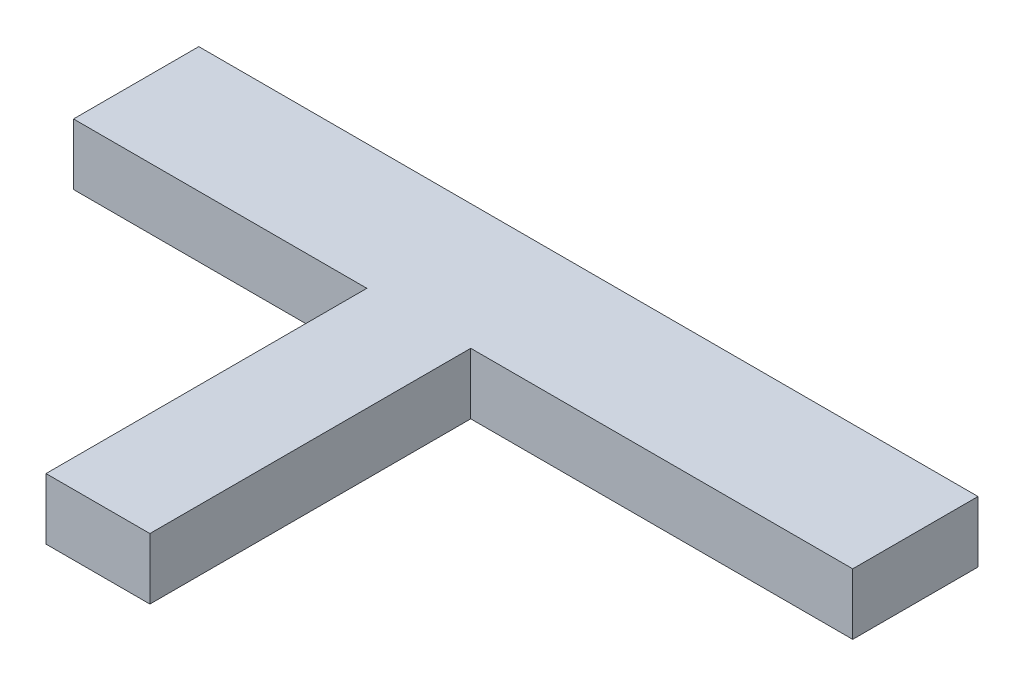
ISO-10303-21;
HEADER;
FILE_DESCRIPTION(('STEP AP214'),'2;1');
FILE_NAME('part.step','',(''),(''),'','','');
FILE_SCHEMA(('AUTOMOTIVE_DESIGN { 1 0 10303 214 1 1 1 1 }'));
ENDSEC;
DATA;
#1=APPLICATION_CONTEXT('core data for automotive mechanical design processes');
#2=APPLICATION_PROTOCOL_DEFINITION('international standard','automotive_design',2000,#1);
#3=PRODUCT_CONTEXT('',#1,'mechanical');
#4=PRODUCT('Part','Part','',(#3));
#5=PRODUCT_RELATED_PRODUCT_CATEGORY('part','',(#4));
#6=PRODUCT_DEFINITION_FORMATION('','',#4);
#7=PRODUCT_DEFINITION_CONTEXT('part definition',#1,'design');
#8=PRODUCT_DEFINITION('design','',#6,#7);
#9=PRODUCT_DEFINITION_SHAPE('','',#8);
#10=(LENGTH_UNIT() NAMED_UNIT(*) SI_UNIT(.MILLI.,.METRE.));
#11=(NAMED_UNIT(*) PLANE_ANGLE_UNIT() SI_UNIT($,.RADIAN.));
#12=(NAMED_UNIT(*) SI_UNIT($,.STERADIAN.) SOLID_ANGLE_UNIT());
#13=UNCERTAINTY_MEASURE_WITH_UNIT(LENGTH_MEASURE(1.E-05),#10,'distance_accuracy_value','');
#14=(GEOMETRIC_REPRESENTATION_CONTEXT(3) GLOBAL_UNCERTAINTY_ASSIGNED_CONTEXT((#13)) GLOBAL_UNIT_ASSIGNED_CONTEXT((#10,
#11,#12)) REPRESENTATION_CONTEXT('',''));
#15=CARTESIAN_POINT('',(0.,0.,0.));
#16=DIRECTION('',(0.,0.,1.));
#17=DIRECTION('',(1.,0.,0.));
#18=AXIS2_PLACEMENT_3D('',#15,#16,#17);
#19=CARTESIAN_POINT('',(-153.890553435114,25.4,-76.3272423664122));
#20=DIRECTION('',(1.,0.,0.));
#21=DIRECTION('',(0.,0.,-1.));
#22=AXIS2_PLACEMENT_3D('',#19,#20,#21);
#23=PLANE('',#22);
#24=DIRECTION('',(0.,1.,0.));
#25=VECTOR('',#24,1.);
#26=CARTESIAN_POINT('',(-153.890553435114,0.,-24.2572423664122));
#27=LINE('',#26,#25);
#28=CARTESIAN_POINT('',(-153.890553435114,0.,-24.2572423664122));
#29=VERTEX_POINT('',#28);
#30=CARTESIAN_POINT('',(-153.890553435114,25.4,-24.2572423664122));
#31=VERTEX_POINT('',#30);
#32=EDGE_CURVE('E62',#29,#31,#27,.T.);
#33=ORIENTED_EDGE('',*,*,#32,.T.);
#34=DIRECTION('',(0.,0.,1.));
#35=VECTOR('',#34,1.);
#36=CARTESIAN_POINT('',(-153.890553435114,25.4,-76.3272423664122));
#37=LINE('',#36,#35);
#38=CARTESIAN_POINT('',(-153.890553435114,25.4,-76.3272423664122));
#39=VERTEX_POINT('',#38);
#40=EDGE_CURVE('E162',#39,#31,#37,.T.);
#41=ORIENTED_EDGE('',*,*,#40,.F.);
#42=DIRECTION('',(0.,-1.,0.));
#43=VECTOR('',#42,1.);
#44=CARTESIAN_POINT('',(-153.890553435114,25.4,-76.3272423664122));
#45=LINE('',#44,#43);
#46=CARTESIAN_POINT('',(-153.890553435114,0.,-76.3272423664122));
#47=VERTEX_POINT('',#46);
#48=EDGE_CURVE('E47',#39,#47,#45,.T.);
#49=ORIENTED_EDGE('',*,*,#48,.T.);
#50=DIRECTION('',(0.,0.,1.));
#51=VECTOR('',#50,1.);
#52=CARTESIAN_POINT('',(-153.890553435114,0.,-76.3272423664122));
#53=LINE('',#52,#51);
#54=EDGE_CURVE('E138',#47,#29,#53,.T.);
#55=ORIENTED_EDGE('',*,*,#54,.T.);
#56=EDGE_LOOP('',(#33,#41,#49,#55));
#57=FACE_BOUND('',#56,.T.);
#58=ADVANCED_FACE('F39',(#57),#23,.F.);
#59=CARTESIAN_POINT('',(-153.890553435114,25.4,109.092757633588));
#60=DIRECTION('',(0.,0.,-1.));
#61=DIRECTION('',(-1.,0.,0.));
#62=AXIS2_PLACEMENT_3D('',#59,#60,#61);
#63=PLANE('',#62);
#64=DIRECTION('',(0.,1.,0.));
#65=VECTOR('',#64,1.);
#66=CARTESIAN_POINT('',(-31.9705534351145,0.,109.092757633588));
#67=LINE('',#66,#65);
#68=CARTESIAN_POINT('',(-31.9705534351145,0.,109.092757633588));
#69=VERTEX_POINT('',#68);
#70=CARTESIAN_POINT('',(-31.9705534351145,25.4,109.092757633588));
#71=VERTEX_POINT('',#70);
#72=EDGE_CURVE('E135',#69,#71,#67,.T.);
#73=ORIENTED_EDGE('',*,*,#72,.F.);
#74=DIRECTION('',(1.,0.,0.));
#75=VECTOR('',#74,1.);
#76=CARTESIAN_POINT('',(-153.890553435114,0.,109.092757633588));
#77=LINE('',#76,#75);
#78=CARTESIAN_POINT('',(11.2094465648855,0.,109.092757633588));
#79=VERTEX_POINT('',#78);
#80=EDGE_CURVE('E125',#69,#79,#77,.T.);
#81=ORIENTED_EDGE('',*,*,#80,.T.);
#82=DIRECTION('',(0.,1.,0.));
#83=VECTOR('',#82,1.);
#84=CARTESIAN_POINT('',(11.2094465648855,0.,109.092757633588));
#85=LINE('',#84,#83);
#86=CARTESIAN_POINT('',(11.2094465648855,25.4,109.092757633588));
#87=VERTEX_POINT('',#86);
#88=EDGE_CURVE('E54',#79,#87,#85,.T.);
#89=ORIENTED_EDGE('',*,*,#88,.T.);
#90=DIRECTION('',(1.,0.,0.));
#91=VECTOR('',#90,1.);
#92=CARTESIAN_POINT('',(-153.890553435114,25.4,109.092757633588));
#93=LINE('',#92,#91);
#94=EDGE_CURVE('E166',#71,#87,#93,.T.);
#95=ORIENTED_EDGE('',*,*,#94,.F.);
#96=EDGE_LOOP('',(#73,#81,#89,#95));
#97=FACE_BOUND('',#96,.T.);
#98=ADVANCED_FACE('F209',(#97),#63,.F.);
#99=CARTESIAN_POINT('',(0.,25.4,0.));
#100=DIRECTION('',(0.,1.,0.));
#101=DIRECTION('',(0.,0.,1.));
#102=AXIS2_PLACEMENT_3D('',#99,#100,#101);
#103=PLANE('',#102);
#104=DIRECTION('',(1.,0.,0.));
#105=VECTOR('',#104,1.);
#106=CARTESIAN_POINT('',(0.,25.4,-24.2572423664122));
#107=LINE('',#106,#105);
#108=CARTESIAN_POINT('',(-31.9705534351145,25.4,-24.2572423664122));
#109=VERTEX_POINT('',#108);
#110=EDGE_CURVE('E127',#31,#109,#107,.T.);
#111=ORIENTED_EDGE('',*,*,#110,.T.);
#112=DIRECTION('',(0.,0.,1.));
#113=VECTOR('',#112,1.);
#114=CARTESIAN_POINT('',(-31.9705534351145,25.4,0.));
#115=LINE('',#114,#113);
#116=EDGE_CURVE('E118',#109,#71,#115,.T.);
#117=ORIENTED_EDGE('',*,*,#116,.T.);
#118=ORIENTED_EDGE('',*,*,#94,.T.);
#119=DIRECTION('',(0.,0.,1.));
#120=VECTOR('',#119,1.);
#121=CARTESIAN_POINT('',(11.2094465648855,25.4,0.));
#122=LINE('',#121,#120);
#123=CARTESIAN_POINT('',(11.2094465648855,25.4,-24.2572423664122));
#124=VERTEX_POINT('',#123);
#125=EDGE_CURVE('E146',#124,#87,#122,.T.);
#126=ORIENTED_EDGE('',*,*,#125,.F.);
#127=DIRECTION('',(-1.,0.,0.));
#128=VECTOR('',#127,1.);
#129=CARTESIAN_POINT('',(0.,25.4,-24.2572423664122));
#130=LINE('',#129,#128);
#131=CARTESIAN_POINT('',(169.959446564886,25.4,-24.2572423664122));
#132=VERTEX_POINT('',#131);
#133=EDGE_CURVE('E150',#132,#124,#130,.T.);
#134=ORIENTED_EDGE('',*,*,#133,.F.);
#135=DIRECTION('',(0.,0.,-1.));
#136=VECTOR('',#135,1.);
#137=CARTESIAN_POINT('',(169.959446564886,25.4,-76.3272423664122));
#138=LINE('',#137,#136);
#139=CARTESIAN_POINT('',(169.959446564886,25.4,-76.3272423664122));
#140=VERTEX_POINT('',#139);
#141=EDGE_CURVE('E171',#132,#140,#138,.T.);
#142=ORIENTED_EDGE('',*,*,#141,.T.);
#143=DIRECTION('',(-1.,0.,0.));
#144=VECTOR('',#143,1.);
#145=CARTESIAN_POINT('',(-153.890553435114,25.4,-76.3272423664122));
#146=LINE('',#145,#144);
#147=EDGE_CURVE('E174',#140,#39,#146,.T.);
#148=ORIENTED_EDGE('',*,*,#147,.T.);
#149=ORIENTED_EDGE('',*,*,#40,.T.);
#150=EDGE_LOOP('',(#111,#117,#118,#126,#134,#142,#148,#149));
#151=FACE_BOUND('',#150,.T.);
#152=ADVANCED_FACE('F205',(#151),#103,.T.);
#153=CARTESIAN_POINT('',(0.,0.,0.));
#154=DIRECTION('',(0.,1.,0.));
#155=DIRECTION('',(0.,0.,1.));
#156=AXIS2_PLACEMENT_3D('',#153,#154,#155);
#157=PLANE('',#156);
#158=DIRECTION('',(0.,0.,1.));
#159=VECTOR('',#158,1.);
#160=CARTESIAN_POINT('',(-31.9705534351145,0.,0.));
#161=LINE('',#160,#159);
#162=CARTESIAN_POINT('',(-31.9705534351145,0.,-24.2572423664122));
#163=VERTEX_POINT('',#162);
#164=EDGE_CURVE('E112',#163,#69,#161,.T.);
#165=ORIENTED_EDGE('',*,*,#164,.F.);
#166=DIRECTION('',(1.,0.,0.));
#167=VECTOR('',#166,1.);
#168=CARTESIAN_POINT('',(0.,0.,-24.2572423664122));
#169=LINE('',#168,#167);
#170=EDGE_CURVE('E102',#29,#163,#169,.T.);
#171=ORIENTED_EDGE('',*,*,#170,.F.);
#172=ORIENTED_EDGE('',*,*,#54,.F.);
#173=DIRECTION('',(-1.,0.,0.));
#174=VECTOR('',#173,1.);
#175=CARTESIAN_POINT('',(-153.890553435114,0.,-76.3272423664122));
#176=LINE('',#175,#174);
#177=CARTESIAN_POINT('',(169.959446564886,0.,-76.3272423664122));
#178=VERTEX_POINT('',#177);
#179=EDGE_CURVE('E167',#178,#47,#176,.T.);
#180=ORIENTED_EDGE('',*,*,#179,.F.);
#181=DIRECTION('',(0.,0.,-1.));
#182=VECTOR('',#181,1.);
#183=CARTESIAN_POINT('',(169.959446564886,0.,-76.3272423664122));
#184=LINE('',#183,#182);
#185=CARTESIAN_POINT('',(169.959446564886,0.,-24.2572423664122));
#186=VERTEX_POINT('',#185);
#187=EDGE_CURVE('E181',#186,#178,#184,.T.);
#188=ORIENTED_EDGE('',*,*,#187,.F.);
#189=DIRECTION('',(-1.,0.,0.));
#190=VECTOR('',#189,1.);
#191=CARTESIAN_POINT('',(0.,0.,-24.2572423664122));
#192=LINE('',#191,#190);
#193=CARTESIAN_POINT('',(11.2094465648855,0.,-24.2572423664122));
#194=VERTEX_POINT('',#193);
#195=EDGE_CURVE('E141',#186,#194,#192,.T.);
#196=ORIENTED_EDGE('',*,*,#195,.T.);
#197=DIRECTION('',(0.,0.,1.));
#198=VECTOR('',#197,1.);
#199=CARTESIAN_POINT('',(11.2094465648855,0.,0.));
#200=LINE('',#199,#198);
#201=EDGE_CURVE('E145',#194,#79,#200,.T.);
#202=ORIENTED_EDGE('',*,*,#201,.T.);
#203=ORIENTED_EDGE('',*,*,#80,.F.);
#204=EDGE_LOOP('',(#165,#171,#172,#180,#188,#196,#202,#203));
#205=FACE_BOUND('',#204,.T.);
#206=ADVANCED_FACE('F123',(#205),#157,.F.);
#207=CARTESIAN_POINT('',(169.959446564886,25.4,-76.3272423664122));
#208=DIRECTION('',(-1.,0.,0.));
#209=DIRECTION('',(0.,0.,1.));
#210=AXIS2_PLACEMENT_3D('',#207,#208,#209);
#211=PLANE('',#210);
#212=ORIENTED_EDGE('',*,*,#141,.F.);
#213=DIRECTION('',(0.,1.,0.));
#214=VECTOR('',#213,1.);
#215=CARTESIAN_POINT('',(169.959446564886,0.,-24.2572423664122));
#216=LINE('',#215,#214);
#217=EDGE_CURVE('E133',#186,#132,#216,.T.);
#218=ORIENTED_EDGE('',*,*,#217,.F.);
#219=ORIENTED_EDGE('',*,*,#187,.T.);
#220=DIRECTION('',(0.,-1.,0.));
#221=VECTOR('',#220,1.);
#222=CARTESIAN_POINT('',(169.959446564886,25.4,-76.3272423664122));
#223=LINE('',#222,#221);
#224=EDGE_CURVE('E11',#140,#178,#223,.T.);
#225=ORIENTED_EDGE('',*,*,#224,.F.);
#226=EDGE_LOOP('',(#212,#218,#219,#225));
#227=FACE_BOUND('',#226,.T.);
#228=ADVANCED_FACE('F198',(#227),#211,.F.);
#229=CARTESIAN_POINT('',(-153.890553435114,25.4,-76.3272423664122));
#230=DIRECTION('',(0.,0.,1.));
#231=DIRECTION('',(1.,0.,0.));
#232=AXIS2_PLACEMENT_3D('',#229,#230,#231);
#233=PLANE('',#232);
#234=ORIENTED_EDGE('',*,*,#179,.T.);
#235=ORIENTED_EDGE('',*,*,#48,.F.);
#236=ORIENTED_EDGE('',*,*,#147,.F.);
#237=ORIENTED_EDGE('',*,*,#224,.T.);
#238=EDGE_LOOP('',(#234,#235,#236,#237));
#239=FACE_BOUND('',#238,.T.);
#240=ADVANCED_FACE('F194',(#239),#233,.F.);
#241=CARTESIAN_POINT('',(0.,0.,-24.2572423664122));
#242=DIRECTION('',(0.,0.,-1.));
#243=DIRECTION('',(-1.,0.,0.));
#244=AXIS2_PLACEMENT_3D('',#241,#242,#243);
#245=PLANE('',#244);
#246=ORIENTED_EDGE('',*,*,#133,.T.);
#247=DIRECTION('',(0.,1.,0.));
#248=VECTOR('',#247,1.);
#249=CARTESIAN_POINT('',(11.2094465648855,0.,-24.2572423664122));
#250=LINE('',#249,#248);
#251=EDGE_CURVE('E149',#194,#124,#250,.T.);
#252=ORIENTED_EDGE('',*,*,#251,.F.);
#253=ORIENTED_EDGE('',*,*,#195,.F.);
#254=ORIENTED_EDGE('',*,*,#217,.T.);
#255=EDGE_LOOP('',(#246,#252,#253,#254));
#256=FACE_BOUND('',#255,.T.);
#257=ADVANCED_FACE('F202',(#256),#245,.F.);
#258=CARTESIAN_POINT('',(11.2094465648855,0.,0.));
#259=DIRECTION('',(-1.,0.,0.));
#260=DIRECTION('',(0.,0.,1.));
#261=AXIS2_PLACEMENT_3D('',#258,#259,#260);
#262=PLANE('',#261);
#263=ORIENTED_EDGE('',*,*,#125,.T.);
#264=ORIENTED_EDGE('',*,*,#88,.F.);
#265=ORIENTED_EDGE('',*,*,#201,.F.);
#266=ORIENTED_EDGE('',*,*,#251,.T.);
#267=EDGE_LOOP('',(#263,#264,#265,#266));
#268=FACE_BOUND('',#267,.T.);
#269=ADVANCED_FACE('F207',(#268),#262,.F.);
#270=CARTESIAN_POINT('',(-31.9705534351145,0.,0.));
#271=DIRECTION('',(-1.,0.,0.));
#272=DIRECTION('',(0.,0.,1.));
#273=AXIS2_PLACEMENT_3D('',#270,#271,#272);
#274=PLANE('',#273);
#275=ORIENTED_EDGE('',*,*,#116,.F.);
#276=DIRECTION('',(0.,1.,0.));
#277=VECTOR('',#276,1.);
#278=CARTESIAN_POINT('',(-31.9705534351145,0.,-24.2572423664122));
#279=LINE('',#278,#277);
#280=EDGE_CURVE('E105',#163,#109,#279,.T.);
#281=ORIENTED_EDGE('',*,*,#280,.F.);
#282=ORIENTED_EDGE('',*,*,#164,.T.);
#283=ORIENTED_EDGE('',*,*,#72,.T.);
#284=EDGE_LOOP('',(#275,#281,#282,#283));
#285=FACE_BOUND('',#284,.T.);
#286=ADVANCED_FACE('F115',(#285),#274,.T.);
#287=CARTESIAN_POINT('',(0.,0.,-24.2572423664122));
#288=DIRECTION('',(0.,0.,1.));
#289=DIRECTION('',(1.,0.,0.));
#290=AXIS2_PLACEMENT_3D('',#287,#288,#289);
#291=PLANE('',#290);
#292=ORIENTED_EDGE('',*,*,#110,.F.);
#293=ORIENTED_EDGE('',*,*,#32,.F.);
#294=ORIENTED_EDGE('',*,*,#170,.T.);
#295=ORIENTED_EDGE('',*,*,#280,.T.);
#296=EDGE_LOOP('',(#292,#293,#294,#295));
#297=FACE_BOUND('',#296,.T.);
#298=ADVANCED_FACE('F104',(#297),#291,.T.);
#299=CLOSED_SHELL('',(#58,#98,#152,#206,#228,#240,#257,#269,#286,#298));
#300=MANIFOLD_SOLID_BREP('B2',#299);
#301=ADVANCED_BREP_SHAPE_REPRESENTATION('',(#18,#300),#14);
#302=SHAPE_DEFINITION_REPRESENTATION(#9,#301);
ENDSEC;
END-ISO-10303-21;
